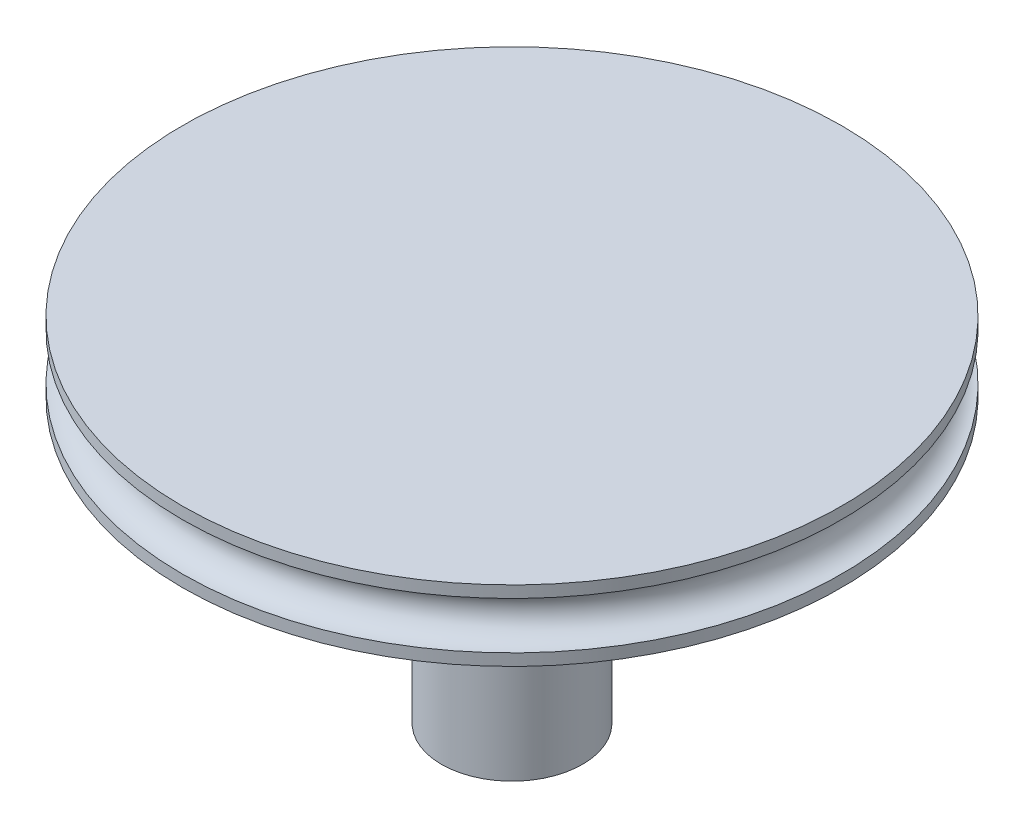
ISO-10303-21;
HEADER;
FILE_DESCRIPTION(('STEP AP214'),'2;1');
FILE_NAME('part.step','',(''),(''),'','','');
FILE_SCHEMA(('AUTOMOTIVE_DESIGN { 1 0 10303 214 1 1 1 1 }'));
ENDSEC;
DATA;
#1=APPLICATION_CONTEXT('core data for automotive mechanical design processes');
#2=APPLICATION_PROTOCOL_DEFINITION('international standard','automotive_design',2000,#1);
#3=PRODUCT_CONTEXT('',#1,'mechanical');
#4=PRODUCT('Part','Part','',(#3));
#5=PRODUCT_RELATED_PRODUCT_CATEGORY('part','',(#4));
#6=PRODUCT_DEFINITION_FORMATION('','',#4);
#7=PRODUCT_DEFINITION_CONTEXT('part definition',#1,'design');
#8=PRODUCT_DEFINITION('design','',#6,#7);
#9=PRODUCT_DEFINITION_SHAPE('','',#8);
#10=(LENGTH_UNIT() NAMED_UNIT(*) SI_UNIT(.MILLI.,.METRE.));
#11=(NAMED_UNIT(*) PLANE_ANGLE_UNIT() SI_UNIT($,.RADIAN.));
#12=(NAMED_UNIT(*) SI_UNIT($,.STERADIAN.) SOLID_ANGLE_UNIT());
#13=UNCERTAINTY_MEASURE_WITH_UNIT(LENGTH_MEASURE(1.E-05),#10,'distance_accuracy_value','');
#14=(GEOMETRIC_REPRESENTATION_CONTEXT(3) GLOBAL_UNCERTAINTY_ASSIGNED_CONTEXT((#13)) GLOBAL_UNIT_ASSIGNED_CONTEXT((#10,
#11,#12)) REPRESENTATION_CONTEXT('',''));
#15=CARTESIAN_POINT('',(0.,0.,0.));
#16=DIRECTION('',(0.,0.,1.));
#17=DIRECTION('',(1.,0.,0.));
#18=AXIS2_PLACEMENT_3D('',#15,#16,#17);
#19=CARTESIAN_POINT('',(0.,3.6,0.));
#20=DIRECTION('',(0.,1.,0.));
#21=DIRECTION('',(0.,0.,1.));
#22=AXIS2_PLACEMENT_3D('',#19,#20,#21);
#23=CYLINDRICAL_SURFACE('',#22,3.);
#24=CARTESIAN_POINT('',(0.,0.,0.));
#25=DIRECTION('',(0.,1.,0.));
#26=DIRECTION('',(0.,0.,1.));
#27=AXIS2_PLACEMENT_3D('',#24,#25,#26);
#28=CIRCLE('',#27,3.);
#29=CARTESIAN_POINT('',(0.,0.,3.));
#30=VERTEX_POINT('',#29);
#31=EDGE_CURVE('E10',#30,#30,#28,.T.);
#32=ORIENTED_EDGE('',*,*,#31,.F.);
#33=EDGE_LOOP('',(#32));
#34=FACE_BOUND('',#33,.T.);
#35=CARTESIAN_POINT('',(0.,-12.,0.));
#36=DIRECTION('',(0.,1.,0.));
#37=DIRECTION('',(0.,0.,1.));
#38=AXIS2_PLACEMENT_3D('',#35,#36,#37);
#39=CIRCLE('',#38,3.);
#40=CARTESIAN_POINT('',(0.,-12.,3.));
#41=VERTEX_POINT('',#40);
#42=EDGE_CURVE('E52',#41,#41,#39,.T.);
#43=ORIENTED_EDGE('',*,*,#42,.T.);
#44=EDGE_LOOP('',(#43));
#45=FACE_BOUND('',#44,.T.);
#46=ADVANCED_FACE('F30',(#34,#45),#23,.T.);
#47=CARTESIAN_POINT('',(3.,0.,0.));
#48=DIRECTION('',(0.,1.,0.));
#49=DIRECTION('',(0.,0.,1.));
#50=AXIS2_PLACEMENT_3D('',#47,#48,#49);
#51=PLANE('',#50);
#52=CARTESIAN_POINT('',(0.,0.,0.));
#53=DIRECTION('',(0.,1.,0.));
#54=DIRECTION('',(0.,0.,1.));
#55=AXIS2_PLACEMENT_3D('',#52,#53,#54);
#56=CIRCLE('',#55,14.);
#57=CARTESIAN_POINT('',(0.,0.,14.));
#58=VERTEX_POINT('',#57);
#59=EDGE_CURVE('E36',#58,#58,#56,.T.);
#60=ORIENTED_EDGE('',*,*,#59,.F.);
#61=EDGE_LOOP('',(#60));
#62=FACE_BOUND('',#61,.T.);
#63=ORIENTED_EDGE('',*,*,#31,.T.);
#64=EDGE_LOOP('',(#63));
#65=FACE_BOUND('',#64,.T.);
#66=ADVANCED_FACE('F68',(#62,#65),#51,.F.);
#67=CARTESIAN_POINT('',(0.,3.6,0.));
#68=DIRECTION('',(0.,1.,0.));
#69=DIRECTION('',(0.,0.,1.));
#70=AXIS2_PLACEMENT_3D('',#67,#68,#69);
#71=CYLINDRICAL_SURFACE('',#70,14.);
#72=CARTESIAN_POINT('',(0.,0.5,0.));
#73=DIRECTION('',(0.,1.,0.));
#74=DIRECTION('',(0.,0.,1.));
#75=AXIS2_PLACEMENT_3D('',#72,#73,#74);
#76=CIRCLE('',#75,14.);
#77=CARTESIAN_POINT('',(0.,0.5,14.));
#78=VERTEX_POINT('',#77);
#79=EDGE_CURVE('E40',#78,#78,#76,.T.);
#80=ORIENTED_EDGE('',*,*,#79,.F.);
#81=EDGE_LOOP('',(#80));
#82=FACE_BOUND('',#81,.T.);
#83=ORIENTED_EDGE('',*,*,#59,.T.);
#84=EDGE_LOOP('',(#83));
#85=FACE_BOUND('',#84,.T.);
#86=ADVANCED_FACE('F73',(#82,#85),#71,.T.);
#87=CARTESIAN_POINT('',(0.,1.5,0.));
#88=DIRECTION('',(0.,1.,0.));
#89=DIRECTION('',(0.,0.,1.));
#90=AXIS2_PLACEMENT_3D('',#87,#88,#89);
#91=TOROIDAL_SURFACE('',#90,14.,1.);
#92=CARTESIAN_POINT('',(0.,2.5,0.));
#93=DIRECTION('',(0.,1.,0.));
#94=DIRECTION('',(0.,0.,1.));
#95=AXIS2_PLACEMENT_3D('',#92,#93,#94);
#96=CIRCLE('',#95,14.);
#97=CARTESIAN_POINT('',(0.,2.5,14.));
#98=VERTEX_POINT('',#97);
#99=EDGE_CURVE('E44',#98,#98,#96,.T.);
#100=ORIENTED_EDGE('',*,*,#99,.F.);
#101=EDGE_LOOP('',(#100));
#102=FACE_BOUND('',#101,.T.);
#103=ORIENTED_EDGE('',*,*,#79,.T.);
#104=EDGE_LOOP('',(#103));
#105=FACE_BOUND('',#104,.T.);
#106=ADVANCED_FACE('F78',(#102,#105),#91,.F.);
#107=CARTESIAN_POINT('',(0.,3.6,0.));
#108=DIRECTION('',(0.,1.,0.));
#109=DIRECTION('',(0.,0.,1.));
#110=AXIS2_PLACEMENT_3D('',#107,#108,#109);
#111=CYLINDRICAL_SURFACE('',#110,14.);
#112=CARTESIAN_POINT('',(0.,3.,0.));
#113=DIRECTION('',(0.,1.,0.));
#114=DIRECTION('',(0.,0.,1.));
#115=AXIS2_PLACEMENT_3D('',#112,#113,#114);
#116=CIRCLE('',#115,14.);
#117=CARTESIAN_POINT('',(0.,3.,14.));
#118=VERTEX_POINT('',#117);
#119=EDGE_CURVE('E49',#118,#118,#116,.T.);
#120=ORIENTED_EDGE('',*,*,#119,.F.);
#121=EDGE_LOOP('',(#120));
#122=FACE_BOUND('',#121,.T.);
#123=ORIENTED_EDGE('',*,*,#99,.T.);
#124=EDGE_LOOP('',(#123));
#125=FACE_BOUND('',#124,.T.);
#126=ADVANCED_FACE('F64',(#122,#125),#111,.T.);
#127=CARTESIAN_POINT('',(14.,3.,0.));
#128=DIRECTION('',(0.,-1.,0.));
#129=DIRECTION('',(0.,0.,-1.));
#130=AXIS2_PLACEMENT_3D('',#127,#128,#129);
#131=PLANE('',#130);
#132=ORIENTED_EDGE('',*,*,#119,.T.);
#133=EDGE_LOOP('',(#132));
#134=FACE_BOUND('',#133,.T.);
#135=ADVANCED_FACE('F59',(#134),#131,.F.);
#136=CARTESIAN_POINT('',(0.,-12.,0.));
#137=DIRECTION('',(0.,1.,0.));
#138=DIRECTION('',(0.,0.,1.));
#139=AXIS2_PLACEMENT_3D('',#136,#137,#138);
#140=PLANE('',#139);
#141=ORIENTED_EDGE('',*,*,#42,.F.);
#142=EDGE_LOOP('',(#141));
#143=FACE_BOUND('',#142,.T.);
#144=ADVANCED_FACE('F57',(#143),#140,.F.);
#145=CLOSED_SHELL('',(#46,#66,#86,#106,#126,#135,#144));
#146=MANIFOLD_SOLID_BREP('B2',#145);
#147=ADVANCED_BREP_SHAPE_REPRESENTATION('',(#18,#146),#14);
#148=SHAPE_DEFINITION_REPRESENTATION(#9,#147);
ENDSEC;
END-ISO-10303-21;
